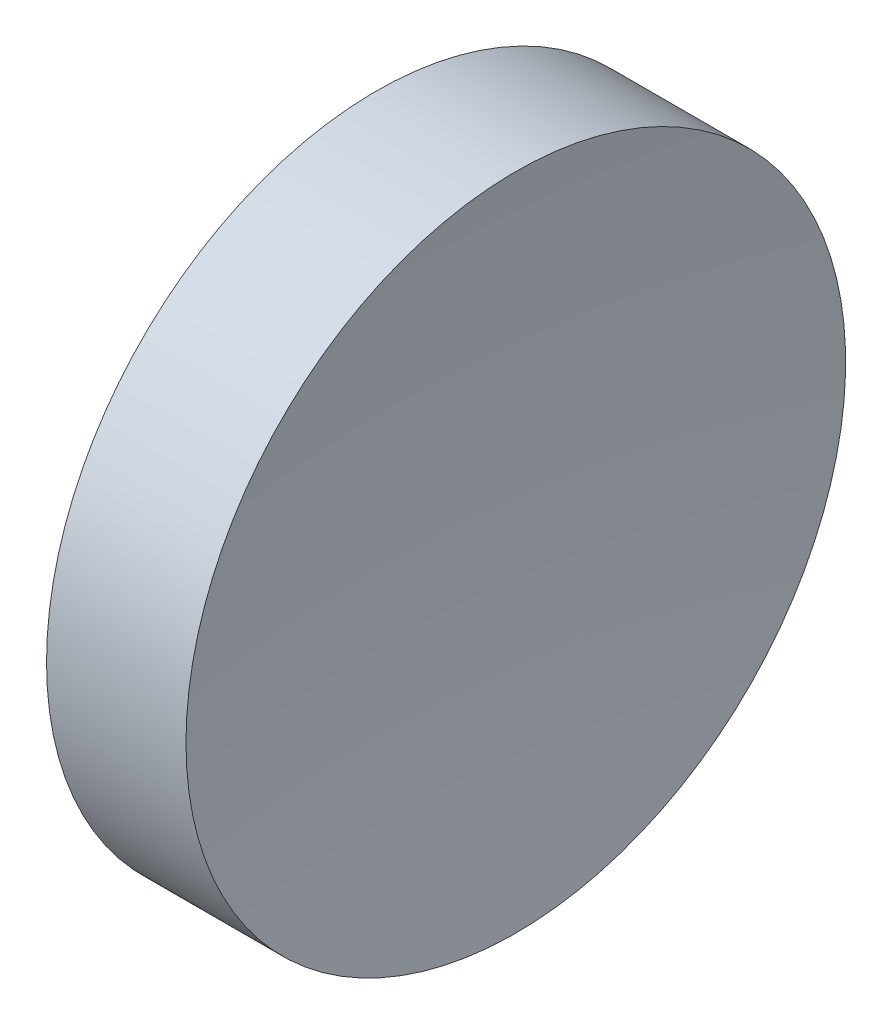
ISO-10303-21;
HEADER;
FILE_DESCRIPTION(('STEP AP214'),'2;1');
FILE_NAME('part.step','',(''),(''),'','','');
FILE_SCHEMA(('AUTOMOTIVE_DESIGN { 1 0 10303 214 1 1 1 1 }'));
ENDSEC;
DATA;
#1=APPLICATION_CONTEXT('core data for automotive mechanical design processes');
#2=APPLICATION_PROTOCOL_DEFINITION('international standard','automotive_design',2000,#1);
#3=PRODUCT_CONTEXT('',#1,'mechanical');
#4=PRODUCT('Part','Part','',(#3));
#5=PRODUCT_RELATED_PRODUCT_CATEGORY('part','',(#4));
#6=PRODUCT_DEFINITION_FORMATION('','',#4);
#7=PRODUCT_DEFINITION_CONTEXT('part definition',#1,'design');
#8=PRODUCT_DEFINITION('design','',#6,#7);
#9=PRODUCT_DEFINITION_SHAPE('','',#8);
#10=(LENGTH_UNIT() NAMED_UNIT(*) SI_UNIT(.MILLI.,.METRE.));
#11=(NAMED_UNIT(*) PLANE_ANGLE_UNIT() SI_UNIT($,.RADIAN.));
#12=(NAMED_UNIT(*) SI_UNIT($,.STERADIAN.) SOLID_ANGLE_UNIT());
#13=UNCERTAINTY_MEASURE_WITH_UNIT(LENGTH_MEASURE(1.E-05),#10,'distance_accuracy_value','');
#14=(GEOMETRIC_REPRESENTATION_CONTEXT(3) GLOBAL_UNCERTAINTY_ASSIGNED_CONTEXT((#13)) GLOBAL_UNIT_ASSIGNED_CONTEXT((#10,
#11,#12)) REPRESENTATION_CONTEXT('',''));
#15=CARTESIAN_POINT('',(0.,0.,0.));
#16=DIRECTION('',(0.,0.,1.));
#17=DIRECTION('',(1.,0.,0.));
#18=AXIS2_PLACEMENT_3D('',#15,#16,#17);
#19=CARTESIAN_POINT('',(439.185311070969,138.756042246745,-9.21280396415369E-06));
#20=DIRECTION('',(0.,-1.,0.));
#21=DIRECTION('',(0.,0.,1.));
#22=AXIS2_PLACEMENT_3D('',#19,#20,#21);
#23=CIRCLE('',#22,200.);
#24=TRIMMED_CURVE('',#23,(PARAMETER_VALUE(-1.57079628073088)),
(PARAMETER_VALUE(1.57079628073088)),.T.,.PARAMETER.);
#25=CARTESIAN_POINT('',(439.185311070969,138.756042246745,0.));
#26=DIRECTION('',(-1.,0.,0.));
#27=AXIS1_PLACEMENT('',#25,#26);
#28=SURFACE_OF_REVOLUTION('',#24,#27);
#29=CARTESIAN_POINT('',(240.753963901829,138.756042246745,0.));
#30=DIRECTION('',(-1.,0.,0.));
#31=DIRECTION('',(0.,0.,1.));
#32=AXIS2_PLACEMENT_3D('',#29,#30,#31);
#33=CIRCLE('',#32,25.);
#34=CARTESIAN_POINT('',(240.753963901829,138.756042246745,25.));
#35=VERTEX_POINT('',#34);
#36=EDGE_CURVE('E11',#35,#35,#33,.T.);
#37=ORIENTED_EDGE('',*,*,#36,.F.);
#38=EDGE_LOOP('',(#37));
#39=FACE_BOUND('',#38,.T.);
#40=CARTESIAN_POINT('',(239.18531107097,138.756042246745,0.));
#41=VERTEX_POINT('',#40);
#42=VERTEX_LOOP('',#41);
#43=FACE_BOUND('',#42,.T.);
#44=ADVANCED_FACE('F37',(#39,#43),#28,.F.);
#45=CARTESIAN_POINT('',(217.97028600433,138.756042246745,0.));
#46=DIRECTION('',(-1.,0.,0.));
#47=DIRECTION('',(0.,0.,1.));
#48=AXIS2_PLACEMENT_3D('',#45,#46,#47);
#49=CYLINDRICAL_SURFACE('',#48,25.);
#50=CARTESIAN_POINT('',(230.185311069839,138.756042246745,0.));
#51=DIRECTION('',(-1.,0.,0.));
#52=DIRECTION('',(0.,0.,1.));
#53=AXIS2_PLACEMENT_3D('',#50,#51,#52);
#54=CIRCLE('',#53,25.);
#55=CARTESIAN_POINT('',(230.185311069839,138.756042246745,25.));
#56=VERTEX_POINT('',#55);
#57=EDGE_CURVE('E43',#56,#56,#54,.T.);
#58=ORIENTED_EDGE('',*,*,#57,.F.);
#59=EDGE_LOOP('',(#58));
#60=FACE_BOUND('',#59,.T.);
#61=ORIENTED_EDGE('',*,*,#36,.T.);
#62=EDGE_LOOP('',(#61));
#63=FACE_BOUND('',#62,.T.);
#64=ADVANCED_FACE('F47',(#60,#63),#49,.T.);
#65=CARTESIAN_POINT('',(230.185311069839,138.756042246745,0.));
#66=DIRECTION('',(1.,0.,0.));
#67=DIRECTION('',(0.,0.,-1.));
#68=AXIS2_PLACEMENT_3D('',#65,#66,#67);
#69=PLANE('',#68);
#70=ORIENTED_EDGE('',*,*,#57,.T.);
#71=EDGE_LOOP('',(#70));
#72=FACE_BOUND('',#71,.T.);
#73=ADVANCED_FACE('F52',(#72),#69,.F.);
#74=CLOSED_SHELL('',(#44,#64,#73));
#75=MANIFOLD_SOLID_BREP('B2',#74);
#76=ADVANCED_BREP_SHAPE_REPRESENTATION('',(#18,#75),#14);
#77=SHAPE_DEFINITION_REPRESENTATION(#9,#76);
ENDSEC;
END-ISO-10303-21;
